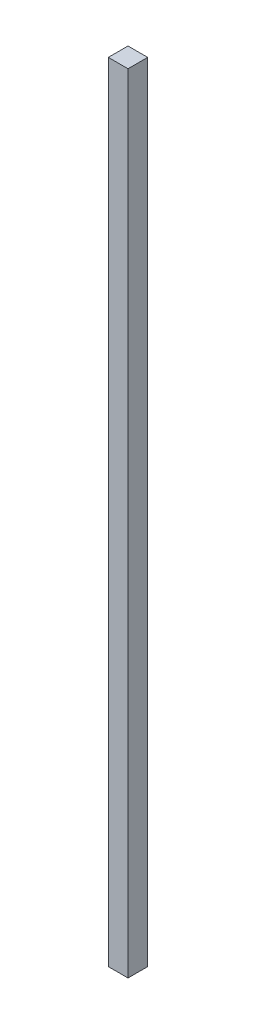
ISO-10303-21;
HEADER;
FILE_DESCRIPTION(('STEP AP214'),'2;1');
FILE_NAME('part.step','',(''),(''),'','','');
FILE_SCHEMA(('AUTOMOTIVE_DESIGN { 1 0 10303 214 1 1 1 1 }'));
ENDSEC;
DATA;
#1=APPLICATION_CONTEXT('core data for automotive mechanical design processes');
#2=APPLICATION_PROTOCOL_DEFINITION('international standard','automotive_design',2000,#1);
#3=PRODUCT_CONTEXT('',#1,'mechanical');
#4=PRODUCT('Part','Part','',(#3));
#5=PRODUCT_RELATED_PRODUCT_CATEGORY('part','',(#4));
#6=PRODUCT_DEFINITION_FORMATION('','',#4);
#7=PRODUCT_DEFINITION_CONTEXT('part definition',#1,'design');
#8=PRODUCT_DEFINITION('design','',#6,#7);
#9=PRODUCT_DEFINITION_SHAPE('','',#8);
#10=(LENGTH_UNIT() NAMED_UNIT(*) SI_UNIT(.MILLI.,.METRE.));
#11=(NAMED_UNIT(*) PLANE_ANGLE_UNIT() SI_UNIT($,.RADIAN.));
#12=(NAMED_UNIT(*) SI_UNIT($,.STERADIAN.) SOLID_ANGLE_UNIT());
#13=UNCERTAINTY_MEASURE_WITH_UNIT(LENGTH_MEASURE(1.E-05),#10,'distance_accuracy_value','');
#14=(GEOMETRIC_REPRESENTATION_CONTEXT(3) GLOBAL_UNCERTAINTY_ASSIGNED_CONTEXT((#13)) GLOBAL_UNIT_ASSIGNED_CONTEXT((#10,
#11,#12)) REPRESENTATION_CONTEXT('',''));
#15=CARTESIAN_POINT('',(0.,0.,0.));
#16=DIRECTION('',(0.,0.,1.));
#17=DIRECTION('',(1.,0.,0.));
#18=AXIS2_PLACEMENT_3D('',#15,#16,#17);
#19=CARTESIAN_POINT('',(1.,80.,-1.));
#20=DIRECTION('',(-1.,0.,0.));
#21=DIRECTION('',(0.,0.,1.));
#22=AXIS2_PLACEMENT_3D('',#19,#20,#21);
#23=PLANE('',#22);
#24=DIRECTION('',(0.,0.,-1.));
#25=VECTOR('',#24,1.);
#26=CARTESIAN_POINT('',(1.,0.,-1.));
#27=LINE('',#26,#25);
#28=CARTESIAN_POINT('',(1.,0.,1.));
#29=VERTEX_POINT('',#28);
#30=CARTESIAN_POINT('',(1.,0.,-1.));
#31=VERTEX_POINT('',#30);
#32=EDGE_CURVE('E98',#29,#31,#27,.T.);
#33=ORIENTED_EDGE('',*,*,#32,.T.);
#34=DIRECTION('',(0.,-1.,0.));
#35=VECTOR('',#34,1.);
#36=CARTESIAN_POINT('',(1.,80.,-1.));
#37=LINE('',#36,#35);
#38=CARTESIAN_POINT('',(1.,80.,-1.));
#39=VERTEX_POINT('',#38);
#40=EDGE_CURVE('E11',#39,#31,#37,.T.);
#41=ORIENTED_EDGE('',*,*,#40,.F.);
#42=DIRECTION('',(0.,0.,-1.));
#43=VECTOR('',#42,1.);
#44=CARTESIAN_POINT('',(1.,80.,-1.));
#45=LINE('',#44,#43);
#46=CARTESIAN_POINT('',(1.,80.,1.));
#47=VERTEX_POINT('',#46);
#48=EDGE_CURVE('E86',#47,#39,#45,.T.);
#49=ORIENTED_EDGE('',*,*,#48,.F.);
#50=DIRECTION('',(0.,-1.,0.));
#51=VECTOR('',#50,1.);
#52=CARTESIAN_POINT('',(1.,80.,1.));
#53=LINE('',#52,#51);
#54=EDGE_CURVE('E94',#47,#29,#53,.T.);
#55=ORIENTED_EDGE('',*,*,#54,.T.);
#56=EDGE_LOOP('',(#33,#41,#49,#55));
#57=FACE_BOUND('',#56,.T.);
#58=ADVANCED_FACE('F35',(#57),#23,.F.);
#59=CARTESIAN_POINT('',(-1.,80.,-1.));
#60=DIRECTION('',(0.,0.,1.));
#61=DIRECTION('',(1.,0.,0.));
#62=AXIS2_PLACEMENT_3D('',#59,#60,#61);
#63=PLANE('',#62);
#64=DIRECTION('',(-1.,0.,0.));
#65=VECTOR('',#64,1.);
#66=CARTESIAN_POINT('',(-1.,0.,-1.));
#67=LINE('',#66,#65);
#68=CARTESIAN_POINT('',(-1.,0.,-1.));
#69=VERTEX_POINT('',#68);
#70=EDGE_CURVE('E90',#31,#69,#67,.T.);
#71=ORIENTED_EDGE('',*,*,#70,.T.);
#72=DIRECTION('',(0.,-1.,0.));
#73=VECTOR('',#72,1.);
#74=CARTESIAN_POINT('',(-1.,80.,-1.));
#75=LINE('',#74,#73);
#76=CARTESIAN_POINT('',(-1.,80.,-1.));
#77=VERTEX_POINT('',#76);
#78=EDGE_CURVE('E43',#77,#69,#75,.T.);
#79=ORIENTED_EDGE('',*,*,#78,.F.);
#80=DIRECTION('',(-1.,0.,0.));
#81=VECTOR('',#80,1.);
#82=CARTESIAN_POINT('',(-1.,80.,-1.));
#83=LINE('',#82,#81);
#84=EDGE_CURVE('E81',#39,#77,#83,.T.);
#85=ORIENTED_EDGE('',*,*,#84,.F.);
#86=ORIENTED_EDGE('',*,*,#40,.T.);
#87=EDGE_LOOP('',(#71,#79,#85,#86));
#88=FACE_BOUND('',#87,.T.);
#89=ADVANCED_FACE('F89',(#88),#63,.F.);
#90=CARTESIAN_POINT('',(-1.,80.,-1.));
#91=DIRECTION('',(1.,0.,0.));
#92=DIRECTION('',(0.,0.,-1.));
#93=AXIS2_PLACEMENT_3D('',#90,#91,#92);
#94=PLANE('',#93);
#95=DIRECTION('',(0.,0.,1.));
#96=VECTOR('',#95,1.);
#97=CARTESIAN_POINT('',(-1.,0.,-1.));
#98=LINE('',#97,#96);
#99=CARTESIAN_POINT('',(-1.,0.,1.));
#100=VERTEX_POINT('',#99);
#101=EDGE_CURVE('E68',#69,#100,#98,.T.);
#102=ORIENTED_EDGE('',*,*,#101,.T.);
#103=DIRECTION('',(0.,-1.,0.));
#104=VECTOR('',#103,1.);
#105=CARTESIAN_POINT('',(-1.,80.,1.));
#106=LINE('',#105,#104);
#107=CARTESIAN_POINT('',(-1.,80.,1.));
#108=VERTEX_POINT('',#107);
#109=EDGE_CURVE('E91',#108,#100,#106,.T.);
#110=ORIENTED_EDGE('',*,*,#109,.F.);
#111=DIRECTION('',(0.,0.,1.));
#112=VECTOR('',#111,1.);
#113=CARTESIAN_POINT('',(-1.,80.,-1.));
#114=LINE('',#113,#112);
#115=EDGE_CURVE('E84',#77,#108,#114,.T.);
#116=ORIENTED_EDGE('',*,*,#115,.F.);
#117=ORIENTED_EDGE('',*,*,#78,.T.);
#118=EDGE_LOOP('',(#102,#110,#116,#117));
#119=FACE_BOUND('',#118,.T.);
#120=ADVANCED_FACE('F92',(#119),#94,.F.);
#121=CARTESIAN_POINT('',(-1.,80.,1.));
#122=DIRECTION('',(0.,0.,-1.));
#123=DIRECTION('',(-1.,0.,0.));
#124=AXIS2_PLACEMENT_3D('',#121,#122,#123);
#125=PLANE('',#124);
#126=DIRECTION('',(1.,0.,0.));
#127=VECTOR('',#126,1.);
#128=CARTESIAN_POINT('',(-1.,0.,1.));
#129=LINE('',#128,#127);
#130=EDGE_CURVE('E74',#100,#29,#129,.T.);
#131=ORIENTED_EDGE('',*,*,#130,.T.);
#132=ORIENTED_EDGE('',*,*,#54,.F.);
#133=DIRECTION('',(1.,0.,0.));
#134=VECTOR('',#133,1.);
#135=CARTESIAN_POINT('',(-1.,80.,1.));
#136=LINE('',#135,#134);
#137=EDGE_CURVE('E51',#108,#47,#136,.T.);
#138=ORIENTED_EDGE('',*,*,#137,.F.);
#139=ORIENTED_EDGE('',*,*,#109,.T.);
#140=EDGE_LOOP('',(#131,#132,#138,#139));
#141=FACE_BOUND('',#140,.T.);
#142=ADVANCED_FACE('F105',(#141),#125,.F.);
#143=CARTESIAN_POINT('',(0.,80.,0.));
#144=DIRECTION('',(0.,1.,0.));
#145=DIRECTION('',(0.,0.,1.));
#146=AXIS2_PLACEMENT_3D('',#143,#144,#145);
#147=PLANE('',#146);
#148=ORIENTED_EDGE('',*,*,#48,.T.);
#149=ORIENTED_EDGE('',*,*,#84,.T.);
#150=ORIENTED_EDGE('',*,*,#115,.T.);
#151=ORIENTED_EDGE('',*,*,#137,.T.);
#152=EDGE_LOOP('',(#148,#149,#150,#151));
#153=FACE_BOUND('',#152,.T.);
#154=ADVANCED_FACE('F82',(#153),#147,.T.);
#155=CARTESIAN_POINT('',(0.,0.,0.));
#156=DIRECTION('',(0.,1.,0.));
#157=DIRECTION('',(0.,0.,1.));
#158=AXIS2_PLACEMENT_3D('',#155,#156,#157);
#159=PLANE('',#158);
#160=ORIENTED_EDGE('',*,*,#32,.F.);
#161=ORIENTED_EDGE('',*,*,#130,.F.);
#162=ORIENTED_EDGE('',*,*,#101,.F.);
#163=ORIENTED_EDGE('',*,*,#70,.F.);
#164=EDGE_LOOP('',(#160,#161,#162,#163));
#165=FACE_BOUND('',#164,.T.);
#166=ADVANCED_FACE('F108',(#165),#159,.F.);
#167=CLOSED_SHELL('',(#58,#89,#120,#142,#154,#166));
#168=MANIFOLD_SOLID_BREP('B2',#167);
#169=ADVANCED_BREP_SHAPE_REPRESENTATION('',(#18,#168),#14);
#170=SHAPE_DEFINITION_REPRESENTATION(#9,#169);
ENDSEC;
END-ISO-10303-21;
